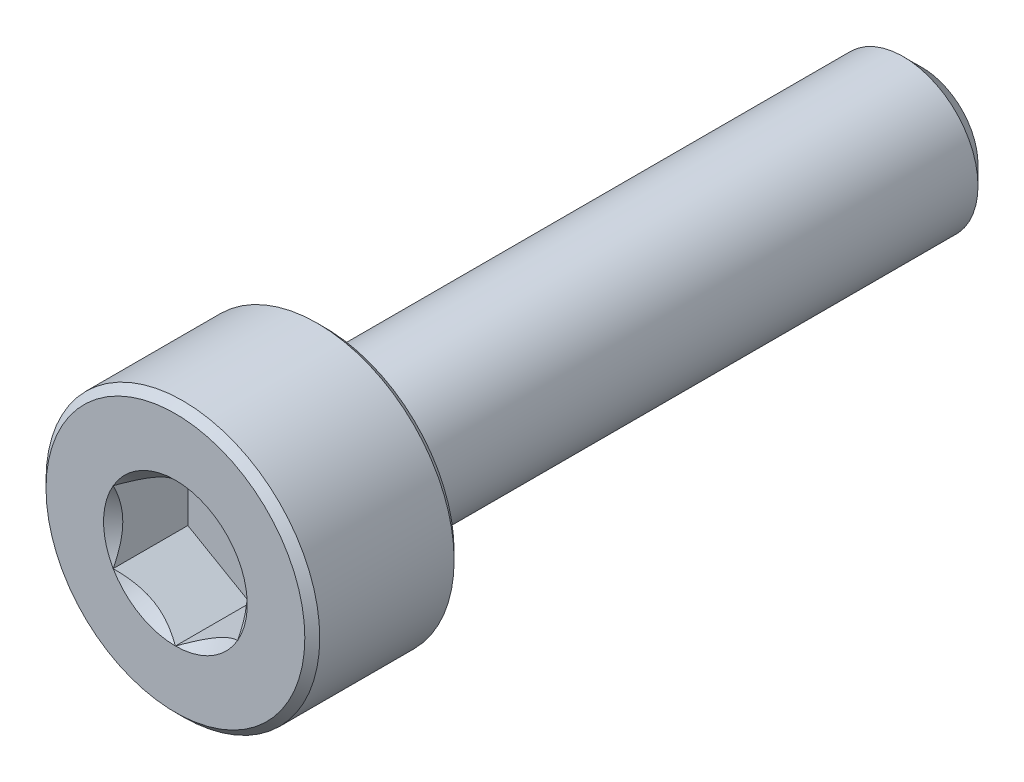
ISO-10303-21;
HEADER;
FILE_DESCRIPTION(('STEP AP214'),'2;1');
FILE_NAME('part.step','',(''),(''),'','','');
FILE_SCHEMA(('AUTOMOTIVE_DESIGN { 1 0 10303 214 1 1 1 1 }'));
ENDSEC;
DATA;
#1=APPLICATION_CONTEXT('core data for automotive mechanical design processes');
#2=APPLICATION_PROTOCOL_DEFINITION('international standard','automotive_design',2000,#1);
#3=PRODUCT_CONTEXT('',#1,'mechanical');
#4=PRODUCT('Part','Part','',(#3));
#5=PRODUCT_RELATED_PRODUCT_CATEGORY('part','',(#4));
#6=PRODUCT_DEFINITION_FORMATION('','',#4);
#7=PRODUCT_DEFINITION_CONTEXT('part definition',#1,'design');
#8=PRODUCT_DEFINITION('design','',#6,#7);
#9=PRODUCT_DEFINITION_SHAPE('','',#8);
#10=(LENGTH_UNIT() NAMED_UNIT(*) SI_UNIT(.MILLI.,.METRE.));
#11=(NAMED_UNIT(*) PLANE_ANGLE_UNIT() SI_UNIT($,.RADIAN.));
#12=(NAMED_UNIT(*) SI_UNIT($,.STERADIAN.) SOLID_ANGLE_UNIT());
#13=UNCERTAINTY_MEASURE_WITH_UNIT(LENGTH_MEASURE(1.E-05),#10,'distance_accuracy_value','');
#14=(GEOMETRIC_REPRESENTATION_CONTEXT(3) GLOBAL_UNCERTAINTY_ASSIGNED_CONTEXT((#13)) GLOBAL_UNIT_ASSIGNED_CONTEXT((#10,
#11,#12)) REPRESENTATION_CONTEXT('',''));
#15=CARTESIAN_POINT('',(0.,0.,0.));
#16=DIRECTION('',(0.,0.,1.));
#17=DIRECTION('',(1.,0.,0.));
#18=AXIS2_PLACEMENT_3D('',#15,#16,#17);
#19=CARTESIAN_POINT('',(0.,0.,7.5));
#20=DIRECTION('',(0.,0.,-1.));
#21=DIRECTION('',(-1.,0.,0.));
#22=AXIS2_PLACEMENT_3D('',#19,#20,#21);
#23=PLANE('',#22);
#24=CARTESIAN_POINT('',(0.,0.,7.5));
#25=DIRECTION('',(0.,0.,-1.));
#26=DIRECTION('',(-1.,0.,0.));
#27=AXIS2_PLACEMENT_3D('',#24,#25,#26);
#28=CIRCLE('',#27,2.6);
#29=CARTESIAN_POINT('',(-2.6,0.,7.5));
#30=VERTEX_POINT('',#29);
#31=EDGE_CURVE('E11',#30,#30,#28,.F.);
#32=ORIENTED_EDGE('',*,*,#31,.T.);
#33=EDGE_LOOP('',(#32));
#34=FACE_BOUND('',#33,.T.);
#35=CARTESIAN_POINT('',(0.,0.,7.5));
#36=DIRECTION('',(0.,0.,1.));
#37=DIRECTION('',(1.,0.,0.));
#38=AXIS2_PLACEMENT_3D('',#35,#36,#37);
#39=CIRCLE('',#38,1.44337567297407);
#40=CARTESIAN_POINT('',(-1.25,0.721687836487033,7.5));
#41=VERTEX_POINT('',#40);
#42=CARTESIAN_POINT('',(-1.25,-0.721687836487033,7.5));
#43=VERTEX_POINT('',#42);
#44=EDGE_CURVE('E129',#41,#43,#39,.T.);
#45=ORIENTED_EDGE('',*,*,#44,.F.);
#46=CARTESIAN_POINT('',(0.,1.44337567297407,7.5));
#47=VERTEX_POINT('',#46);
#48=EDGE_CURVE('E97',#47,#41,#39,.T.);
#49=ORIENTED_EDGE('',*,*,#48,.F.);
#50=CARTESIAN_POINT('',(1.25,0.721687836487033,7.5));
#51=VERTEX_POINT('',#50);
#52=EDGE_CURVE('E88',#51,#47,#39,.T.);
#53=ORIENTED_EDGE('',*,*,#52,.F.);
#54=CARTESIAN_POINT('',(1.25,-0.721687836487033,7.5));
#55=VERTEX_POINT('',#54);
#56=EDGE_CURVE('E49',#55,#51,#39,.T.);
#57=ORIENTED_EDGE('',*,*,#56,.F.);
#58=CARTESIAN_POINT('',(0.,-1.44337567297407,7.5));
#59=VERTEX_POINT('',#58);
#60=EDGE_CURVE('E56',#59,#55,#39,.T.);
#61=ORIENTED_EDGE('',*,*,#60,.F.);
#62=EDGE_CURVE('E130',#43,#59,#39,.T.);
#63=ORIENTED_EDGE('',*,*,#62,.F.);
#64=EDGE_LOOP('',(#45,#49,#53,#57,#61,#63));
#65=FACE_BOUND('',#64,.T.);
#66=ADVANCED_FACE('F35',(#34,#65),#23,.F.);
#67=CARTESIAN_POINT('',(0.,0.,7.5));
#68=DIRECTION('',(0.,0.,1.));
#69=DIRECTION('',(1.,0.,0.));
#70=AXIS2_PLACEMENT_3D('',#67,#68,#69);
#71=CYLINDRICAL_SURFACE('',#70,2.75);
#72=CARTESIAN_POINT('',(0.,0.,4.65));
#73=DIRECTION('',(0.,0.,1.));
#74=DIRECTION('',(1.,0.,0.));
#75=AXIS2_PLACEMENT_3D('',#72,#73,#74);
#76=CIRCLE('',#75,2.75);
#77=CARTESIAN_POINT('',(2.75,0.,4.65));
#78=VERTEX_POINT('',#77);
#79=EDGE_CURVE('E172',#78,#78,#76,.T.);
#80=ORIENTED_EDGE('',*,*,#79,.T.);
#81=EDGE_LOOP('',(#80));
#82=FACE_BOUND('',#81,.T.);
#83=CARTESIAN_POINT('',(0.,0.,7.35));
#84=DIRECTION('',(0.,0.,-1.));
#85=DIRECTION('',(-1.,0.,0.));
#86=AXIS2_PLACEMENT_3D('',#83,#84,#85);
#87=CIRCLE('',#86,2.75);
#88=CARTESIAN_POINT('',(-2.75,0.,7.35));
#89=VERTEX_POINT('',#88);
#90=EDGE_CURVE('E107',#89,#89,#87,.T.);
#91=ORIENTED_EDGE('',*,*,#90,.T.);
#92=EDGE_LOOP('',(#91));
#93=FACE_BOUND('',#92,.T.);
#94=ADVANCED_FACE('F185',(#82,#93),#71,.T.);
#95=CARTESIAN_POINT('',(0.,2.75,4.5));
#96=DIRECTION('',(0.,0.,1.));
#97=DIRECTION('',(1.,0.,0.));
#98=AXIS2_PLACEMENT_3D('',#95,#96,#97);
#99=PLANE('',#98);
#100=CARTESIAN_POINT('',(0.,0.,4.5));
#101=DIRECTION('',(0.,0.,1.));
#102=DIRECTION('',(1.,0.,0.));
#103=AXIS2_PLACEMENT_3D('',#100,#101,#102);
#104=CIRCLE('',#103,2.6);
#105=CARTESIAN_POINT('',(2.6,0.,4.5));
#106=VERTEX_POINT('',#105);
#107=EDGE_CURVE('E43',#106,#106,#104,.F.);
#108=ORIENTED_EDGE('',*,*,#107,.T.);
#109=EDGE_LOOP('',(#108));
#110=FACE_BOUND('',#109,.T.);
#111=CARTESIAN_POINT('',(0.,0.,4.5));
#112=DIRECTION('',(0.,0.,1.));
#113=DIRECTION('',(1.,0.,0.));
#114=AXIS2_PLACEMENT_3D('',#111,#112,#113);
#115=CIRCLE('',#114,1.5);
#116=CARTESIAN_POINT('',(1.5,0.,4.5));
#117=VERTEX_POINT('',#116);
#118=EDGE_CURVE('E108',#117,#117,#115,.T.);
#119=ORIENTED_EDGE('',*,*,#118,.T.);
#120=EDGE_LOOP('',(#119));
#121=FACE_BOUND('',#120,.T.);
#122=ADVANCED_FACE('F177',(#110,#121),#99,.F.);
#123=CARTESIAN_POINT('',(0.,0.,7.5));
#124=DIRECTION('',(0.,0.,1.));
#125=DIRECTION('',(1.,0.,0.));
#126=AXIS2_PLACEMENT_3D('',#123,#124,#125);
#127=CYLINDRICAL_SURFACE('',#126,1.5);
#128=ORIENTED_EDGE('',*,*,#118,.F.);
#129=EDGE_LOOP('',(#128));
#130=FACE_BOUND('',#129,.T.);
#131=CARTESIAN_POINT('',(0.,0.,-7.125));
#132=DIRECTION('',(0.,0.,1.));
#133=DIRECTION('',(1.,0.,0.));
#134=AXIS2_PLACEMENT_3D('',#131,#132,#133);
#135=CIRCLE('',#134,1.5);
#136=CARTESIAN_POINT('',(1.5,0.,-7.125));
#137=VERTEX_POINT('',#136);
#138=EDGE_CURVE('E222',#137,#137,#135,.T.);
#139=ORIENTED_EDGE('',*,*,#138,.T.);
#140=EDGE_LOOP('',(#139));
#141=FACE_BOUND('',#140,.T.);
#142=ADVANCED_FACE('F203',(#130,#141),#127,.T.);
#143=CARTESIAN_POINT('',(0.,0.,-7.5));
#144=DIRECTION('',(0.,0.,1.));
#145=DIRECTION('',(1.,0.,0.));
#146=AXIS2_PLACEMENT_3D('',#143,#144,#145);
#147=CONICAL_SURFACE('',#146,1.125,0.785398163397451);
#148=ORIENTED_EDGE('',*,*,#138,.F.);
#149=EDGE_LOOP('',(#148));
#150=FACE_BOUND('',#149,.T.);
#151=CARTESIAN_POINT('',(0.,0.,-7.5));
#152=DIRECTION('',(0.,0.,1.));
#153=DIRECTION('',(1.,0.,0.));
#154=AXIS2_PLACEMENT_3D('',#151,#152,#153);
#155=CIRCLE('',#154,1.125);
#156=CARTESIAN_POINT('',(1.125,0.,-7.5));
#157=VERTEX_POINT('',#156);
#158=EDGE_CURVE('E220',#157,#157,#155,.T.);
#159=ORIENTED_EDGE('',*,*,#158,.T.);
#160=EDGE_LOOP('',(#159));
#161=FACE_BOUND('',#160,.T.);
#162=ADVANCED_FACE('F206',(#150,#161),#147,.T.);
#163=CARTESIAN_POINT('',(0.,1.125,-7.5));
#164=DIRECTION('',(0.,0.,1.));
#165=DIRECTION('',(1.,0.,0.));
#166=AXIS2_PLACEMENT_3D('',#163,#164,#165);
#167=PLANE('',#166);
#168=ORIENTED_EDGE('',*,*,#158,.F.);
#169=EDGE_LOOP('',(#168));
#170=FACE_BOUND('',#169,.T.);
#171=ADVANCED_FACE('F209',(#170),#167,.F.);
#172=CARTESIAN_POINT('',(0.,0.,7.5));
#173=DIRECTION('',(0.,0.,1.));
#174=DIRECTION('',(1.,0.,0.));
#175=AXIS2_PLACEMENT_3D('',#172,#173,#174);
#176=CONICAL_SURFACE('',#175,1.44337567297407,0.78539816339745);
#177=ORIENTED_EDGE('',*,*,#48,.T.);
#178=CARTESIAN_POINT('',(0.000199999999999862,1.4434911430279,7.50011548390914));
#179=CARTESIAN_POINT('',(-0.0427751670715868,1.41867941875065,7.4753216680551));
#180=CARTESIAN_POINT('',(-0.0864690047459482,1.39345276980743,7.45198373441868));
#181=CARTESIAN_POINT('',(-0.175565930841942,1.34201263554194,7.40925200408454));
#182=CARTESIAN_POINT('',(-0.220977498357064,1.31579425481276,7.38988199236041));
#183=CARTESIAN_POINT('',(-0.31254782093526,1.26292610442246,7.35670048341348));
#184=CARTESIAN_POINT('',(-0.358683240175885,1.23628980770471,7.34280555905266));
#185=CARTESIAN_POINT('',(-0.451970080407592,1.18243062538508,7.32139728216064));
#186=CARTESIAN_POINT('',(-0.499118649136379,1.15520938653761,7.31386794156679));
#187=CARTESIAN_POINT('',(-0.580373556887252,1.10829684367467,7.3070744980507));
#188=CARTESIAN_POINT('',(-0.61437487662794,1.08866617256958,7.30606855910435));
#189=CARTESIAN_POINT('',(-0.682317764432477,1.04943932800611,7.30776141491132));
#190=CARTESIAN_POINT('',(-0.716259317655657,1.02984316311599,7.31046102721554));
#191=CARTESIAN_POINT('',(-0.783814856457499,0.9908399546035,7.31940893031638));
#192=CARTESIAN_POINT('',(-0.817428507286774,0.971433104248772,7.32566052589971));
#193=CARTESIAN_POINT('',(-0.884094638217812,0.932943395609906,7.3413756814139));
#194=CARTESIAN_POINT('',(-0.917146871030295,0.913860680098302,7.35084062008746));
#195=CARTESIAN_POINT('',(-1.00179969160026,0.864986351354569,7.37893139068759));
#196=CARTESIAN_POINT('',(-1.05286649242964,0.835502920149077,7.3996701574522));
#197=CARTESIAN_POINT('',(-1.15300085411326,0.777690319475909,7.44638713467148));
#198=CARTESIAN_POINT('',(-1.20207431157827,0.749357745598418,7.47234829594677));
#199=CARTESIAN_POINT('',(-1.2502,0.721572366433195,7.50011548390914));
#200=B_SPLINE_CURVE_WITH_KNOTS('',3,(#178,#179,#180,#181,#182,#183,#184,#185,#186,#187,#188,
#189,#190,#191,#192,#193,#194,#195,#196,#197,#198,#199),.UNSPECIFIED.,.F.,.F.,(4,2,2,2,2,2,2,2,
2,2,4),(0.,0.166533409618304,0.334037607289761,0.498880396489697,0.663307919240273,
0.780963963458826,0.898645970148452,1.01643764860773,1.13427993171549,1.32148652032141,
1.50809158792574),.UNSPECIFIED.);
#201=EDGE_CURVE('E102',#47,#41,#200,.T.);
#202=ORIENTED_EDGE('',*,*,#201,.F.);
#203=EDGE_LOOP('',(#177,#202));
#204=FACE_BOUND('',#203,.T.);
#205=ADVANCED_FACE('F103',(#204),#176,.F.);
#206=ORIENTED_EDGE('',*,*,#44,.T.);
#207=CARTESIAN_POINT('',(-1.25,-1.43934010829019,7.96298209705044));
#208=CARTESIAN_POINT('',(-1.25,-1.40429313026013,7.93652492278491));
#209=CARTESIAN_POINT('',(-1.25,-1.36905087155364,7.91032716050022));
#210=CARTESIAN_POINT('',(-1.25,-1.29809650724891,7.8585575719734));
#211=CARTESIAN_POINT('',(-1.25,-1.2623842859448,7.83298590448406));
#212=CARTESIAN_POINT('',(-1.25,-1.1539011180887,7.75700599379898));
#213=CARTESIAN_POINT('',(-1.25,-1.08031646741187,7.70774028628697));
#214=CARTESIAN_POINT('',(-1.25,-0.926012322877302,7.61102583033562));
#215=CARTESIAN_POINT('',(-1.25,-0.845125318763648,7.56384129900157));
#216=CARTESIAN_POINT('',(-1.25,-0.679311174153443,7.47753073442661));
#217=CARTESIAN_POINT('',(-1.25,-0.594398891087583,7.43837753465223));
#218=CARTESIAN_POINT('',(-1.25,-0.466944812509639,7.39047722370555));
#219=CARTESIAN_POINT('',(-1.25,-0.426289985866744,7.37672948980391));
#220=CARTESIAN_POINT('',(-1.25,-0.343998850155402,7.35249792746773));
#221=CARTESIAN_POINT('',(-1.25,-0.302362473684285,7.34201432388626));
#222=CARTESIAN_POINT('',(-1.25,-0.219052696365194,7.3250301617622));
#223=CARTESIAN_POINT('',(-1.25,-0.177393428559043,7.31846136048343));
#224=CARTESIAN_POINT('',(-1.25,-0.0936293694345974,7.30943505346499));
#225=CARTESIAN_POINT('',(-1.25,-0.0515246559536482,7.30697684100151));
#226=CARTESIAN_POINT('',(-1.25,0.0311890575224394,7.30635406201072));
#227=CARTESIAN_POINT('',(-1.25,0.0717969624376327,7.30803711683992));
#228=CARTESIAN_POINT('',(-1.25,0.152668636765093,7.31526827058346));
#229=CARTESIAN_POINT('',(-1.25,0.192932338711554,7.3208171103943));
#230=CARTESIAN_POINT('',(-1.25,0.273499879034189,7.33557103643701));
#231=CARTESIAN_POINT('',(-1.25,0.313792180483815,7.34483817593136));
#232=CARTESIAN_POINT('',(-1.25,0.393496413769926,7.36653617841489));
#233=CARTESIAN_POINT('',(-1.25,0.432908418970283,7.37896677668328));
#234=CARTESIAN_POINT('',(-1.25,0.556992735685998,7.42277935286094));
#235=CARTESIAN_POINT('',(-1.25,0.639898924463084,7.45915107278417));
#236=CARTESIAN_POINT('',(-1.25,0.801816555245349,7.54001916204164));
#237=CARTESIAN_POINT('',(-1.25,0.880812666046054,7.58454472075164));
#238=CARTESIAN_POINT('',(-1.25,1.03178561247421,7.67640487646102));
#239=CARTESIAN_POINT('',(-1.25,1.10391618450775,7.72348993368923));
#240=CARTESIAN_POINT('',(-1.25,1.2101860600607,7.79627856133952));
#241=CARTESIAN_POINT('',(-1.25,1.24515069931176,7.82079808512376));
#242=CARTESIAN_POINT('',(-1.25,1.31460220812615,7.87048563647493));
#243=CARTESIAN_POINT('',(-1.25,1.3490892055554,7.8956534851142));
#244=CARTESIAN_POINT('',(-1.25,1.38337731640879,7.92109014852934));
#245=B_SPLINE_CURVE_WITH_KNOTS('',3,(#207,#208,#209,#210,#211,#212,#213,#214,#215,#216,#217,
#218,#219,#220,#221,#222,#223,#224,#225,#226,#227,#228,#229,#230,#231,#232,#233,#234,#235,#236,
#237,#238,#239,#240,#241,#242,#243,#244),.UNSPECIFIED.,.F.,.F.,(4,2,2,2,2,2,2,2,2,2,2,2,2,2,2,2,
2,2,4),(0.,0.131732960406522,0.2634989842118,0.529042014557081,0.809741926293179,
1.08947609738757,1.21811634292656,1.34676544802529,1.47310084535082,1.59941451989631,
1.72115042182424,1.84290966145034,1.96679153917269,2.09066305376595,2.36146692896707,
2.63325989189267,2.89154668194565,3.01965734485811,3.1477330221954),.UNSPECIFIED.);
#246=EDGE_CURVE('E96',#41,#43,#245,.F.);
#247=ORIENTED_EDGE('',*,*,#246,.F.);
#248=EDGE_LOOP('',(#206,#247));
#249=FACE_BOUND('',#248,.T.);
#250=ADVANCED_FACE('F217',(#249),#176,.F.);
#251=ORIENTED_EDGE('',*,*,#62,.T.);
#252=CARTESIAN_POINT('',(-1.2502,-0.721572366433194,7.50011548390914));
#253=CARTESIAN_POINT('',(-1.20722483292841,-0.746384090710444,7.4753216680551));
#254=CARTESIAN_POINT('',(-1.16353099525405,-0.771610739653664,7.45198373441868));
#255=CARTESIAN_POINT('',(-1.07443406915806,-0.823050873919154,7.40925200408454));
#256=CARTESIAN_POINT('',(-1.02902250164294,-0.849269254648333,7.38988199236041));
#257=CARTESIAN_POINT('',(-0.937452179064741,-0.902137405038635,7.35670048341347));
#258=CARTESIAN_POINT('',(-0.891316759824115,-0.928773701756387,7.34280555905265));
#259=CARTESIAN_POINT('',(-0.798029919592408,-0.982632884076012,7.32139728216064));
#260=CARTESIAN_POINT('',(-0.75088135086362,-1.00985412292348,7.31386794156679));
#261=CARTESIAN_POINT('',(-0.669626443112748,-1.05676666578643,7.3070744980507));
#262=CARTESIAN_POINT('',(-0.635625123372059,-1.07639733689152,7.30606855910435));
#263=CARTESIAN_POINT('',(-0.567682235567523,-1.11562418145499,7.30776141491132));
#264=CARTESIAN_POINT('',(-0.533740682344343,-1.1352203463451,7.31046102721554));
#265=CARTESIAN_POINT('',(-0.466185143542501,-1.1742235548576,7.31940893031638));
#266=CARTESIAN_POINT('',(-0.432571492713225,-1.19363040521233,7.3256605258997));
#267=CARTESIAN_POINT('',(-0.365905361782187,-1.23212011385119,7.3413756814139));
#268=CARTESIAN_POINT('',(-0.332853128969705,-1.2512028293628,7.35084062008746));
#269=CARTESIAN_POINT('',(-0.248200308399735,-1.30007715810653,7.37893139068758));
#270=CARTESIAN_POINT('',(-0.197133507570362,-1.32956058931202,7.3996701574522));
#271=CARTESIAN_POINT('',(-0.0969991458867448,-1.38737318998519,7.44638713467148));
#272=CARTESIAN_POINT('',(-0.04792568842173,-1.41570576386268,7.47234829594677));
#273=CARTESIAN_POINT('',(0.000200000000000719,-1.4434911430279,7.50011548390914));
#274=B_SPLINE_CURVE_WITH_KNOTS('',3,(#252,#253,#254,#255,#256,#257,#258,#259,#260,#261,#262,
#263,#264,#265,#266,#267,#268,#269,#270,#271,#272,#273),.UNSPECIFIED.,.F.,.F.,(4,2,2,2,2,2,2,2,
2,2,4),(0.,0.166533409618304,0.334037607289762,0.498880396489699,0.663307919240275,
0.780963963458827,0.898645970148453,1.01643764860773,1.1342799317155,1.32148652032141,
1.50809158792574),.UNSPECIFIED.);
#275=EDGE_CURVE('E140',#43,#59,#274,.T.);
#276=ORIENTED_EDGE('',*,*,#275,.F.);
#277=EDGE_LOOP('',(#251,#276));
#278=FACE_BOUND('',#277,.T.);
#279=ADVANCED_FACE('F282',(#278),#176,.F.);
#280=ORIENTED_EDGE('',*,*,#60,.T.);
#281=CARTESIAN_POINT('',(-0.000199999999999386,-1.4434911430279,7.50011548390914));
#282=CARTESIAN_POINT('',(0.0427751670715872,-1.41867941875065,7.4753216680551));
#283=CARTESIAN_POINT('',(0.0864690047459485,-1.39345276980743,7.45198373441868));
#284=CARTESIAN_POINT('',(0.175565930841942,-1.34201263554194,7.40925200408454));
#285=CARTESIAN_POINT('',(0.220977498357064,-1.31579425481276,7.38988199236041));
#286=CARTESIAN_POINT('',(0.31254782093526,-1.26292610442246,7.35670048341348));
#287=CARTESIAN_POINT('',(0.358683240175886,-1.23628980770471,7.34280555905266));
#288=CARTESIAN_POINT('',(0.451970080407592,-1.18243062538508,7.32139728216064));
#289=CARTESIAN_POINT('',(0.49911864913638,-1.15520938653761,7.31386794156679));
#290=CARTESIAN_POINT('',(0.580373556887252,-1.10829684367467,7.3070744980507));
#291=CARTESIAN_POINT('',(0.614374876627941,-1.08866617256958,7.30606855910435));
#292=CARTESIAN_POINT('',(0.682317764432478,-1.04943932800611,7.30776141491132));
#293=CARTESIAN_POINT('',(0.716259317655658,-1.02984316311599,7.31046102721554));
#294=CARTESIAN_POINT('',(0.7838148564575,-0.9908399546035,7.31940893031638));
#295=CARTESIAN_POINT('',(0.817428507286775,-0.971433104248772,7.32566052589971));
#296=CARTESIAN_POINT('',(0.884094638217813,-0.932943395609906,7.3413756814139));
#297=CARTESIAN_POINT('',(0.917146871030296,-0.913860680098301,7.35084062008746));
#298=CARTESIAN_POINT('',(1.00179969160026,-0.864986351354569,7.37893139068759));
#299=CARTESIAN_POINT('',(1.05286649242964,-0.835502920149077,7.3996701574522));
#300=CARTESIAN_POINT('',(1.15300085411325,-0.777690319475909,7.44638713467148));
#301=CARTESIAN_POINT('',(1.20207431157827,-0.749357745598418,7.47234829594677));
#302=CARTESIAN_POINT('',(1.2502,-0.721572366433195,7.50011548390914));
#303=B_SPLINE_CURVE_WITH_KNOTS('',3,(#281,#282,#283,#284,#285,#286,#287,#288,#289,#290,#291,
#292,#293,#294,#295,#296,#297,#298,#299,#300,#301,#302),.UNSPECIFIED.,.F.,.F.,(4,2,2,2,2,2,2,2,
2,2,4),(0.,0.166533409618303,0.334037607289761,0.498880396489697,0.663307919240273,
0.780963963458826,0.898645970148452,1.01643764860773,1.13427993171549,1.32148652032141,
1.50809158792573),.UNSPECIFIED.);
#304=EDGE_CURVE('E259',#59,#55,#303,.T.);
#305=ORIENTED_EDGE('',*,*,#304,.F.);
#306=EDGE_LOOP('',(#280,#305));
#307=FACE_BOUND('',#306,.T.);
#308=ADVANCED_FACE('F283',(#307),#176,.F.);
#309=ORIENTED_EDGE('',*,*,#56,.T.);
#310=CARTESIAN_POINT('',(1.25,-1.43934010808077,7.96298209689233));
#311=CARTESIAN_POINT('',(1.25,-1.40429313005659,7.93652492263289));
#312=CARTESIAN_POINT('',(1.25,-1.36905087135599,7.91032716035428));
#313=CARTESIAN_POINT('',(1.25,-1.29809650706311,7.85855757183958));
#314=CARTESIAN_POINT('',(1.25,-1.26238428576495,7.83298590435629));
#315=CARTESIAN_POINT('',(1.25,-1.15390111792708,7.75700599368946));
#316=CARTESIAN_POINT('',(1.25,-1.08031646726264,7.70774028618957));
#317=CARTESIAN_POINT('',(1.25,-0.926012322755096,7.61102583026313));
#318=CARTESIAN_POINT('',(1.25,-0.845125318656147,7.5638412989418));
#319=CARTESIAN_POINT('',(1.25,-0.679311174076603,7.47753073439041));
#320=CARTESIAN_POINT('',(1.25,-0.594398891026688,7.4383775346269));
#321=CARTESIAN_POINT('',(1.25,-0.466944812460741,7.39047722368829));
#322=CARTESIAN_POINT('',(1.25,-0.426289985812822,7.37672948978634));
#323=CARTESIAN_POINT('',(1.25,-0.343998850091268,7.35249792745054));
#324=CARTESIAN_POINT('',(1.25,-0.302362473614962,7.34201432386977));
#325=CARTESIAN_POINT('',(1.25,-0.219052696285666,7.3250301617483));
#326=CARTESIAN_POINT('',(1.25,-0.1773934284745,7.31846136047137));
#327=CARTESIAN_POINT('',(1.25,-0.0936293693401926,7.30943505345776));
#328=CARTESIAN_POINT('',(1.25,-0.0515246558543965,7.30697684099727));
#329=CARTESIAN_POINT('',(1.25,0.0311890576306311,7.30635406201328));
#330=CARTESIAN_POINT('',(1.25,0.0717969625499299,7.30803711684625));
#331=CARTESIAN_POINT('',(1.25,0.152668636885197,7.31526827059791));
#332=CARTESIAN_POINT('',(1.25,0.192932338835358,7.32081711041311));
#333=CARTESIAN_POINT('',(1.25,0.273499879165295,7.33557103646495));
#334=CARTESIAN_POINT('',(1.25,0.313792180618511,7.3448381759641));
#335=CARTESIAN_POINT('',(1.25,0.393496413911457,7.36653617845735));
#336=CARTESIAN_POINT('',(1.25,0.432908419115059,7.37896677673064));
#337=CARTESIAN_POINT('',(1.25,0.556992735862298,7.42277935293144));
#338=CARTESIAN_POINT('',(1.25,0.639898924666086,7.45915107287596));
#339=CARTESIAN_POINT('',(1.25,0.801816555499702,7.54001916217833));
#340=CARTESIAN_POINT('',(1.25,0.880812666325045,7.58454472091199));
#341=CARTESIAN_POINT('',(1.25,1.0317856127975,7.67640487666662));
#342=CARTESIAN_POINT('',(1.25,1.10391618485086,7.72348993391625));
#343=CARTESIAN_POINT('',(1.25,1.21018606043311,7.79627856159854));
#344=CARTESIAN_POINT('',(1.25,1.24515069969379,7.82079808539336));
#345=CARTESIAN_POINT('',(1.25,1.31460220852736,7.87048563676568));
#346=CARTESIAN_POINT('',(1.25,1.34908920596618,7.89565348541552));
#347=CARTESIAN_POINT('',(1.25,1.38337731682912,7.92109014884121));
#348=B_SPLINE_CURVE_WITH_KNOTS('',3,(#310,#311,#312,#313,#314,#315,#316,#317,#318,#319,#320,
#321,#322,#323,#324,#325,#326,#327,#328,#329,#330,#331,#332,#333,#334,#335,#336,#337,#338,#339,
#340,#341,#342,#343,#344,#345,#346,#347),.UNSPECIFIED.,.F.,.F.,(4,2,2,2,2,2,2,2,2,2,2,2,2,2,2,2,
2,2,4),(0.,0.131732960381448,0.263498984161645,0.529042014455825,0.809741926134618,
1.08947609717225,1.21811634272577,1.346765447839,1.47310084517844,1.59941451973784,
1.72115042167849,1.84290966131735,1.96679153905342,2.09066305366039,2.36146692896009,
2.63325989198491,2.89154668212279,3.01965734507713,3.14773302245628),.UNSPECIFIED.);
#349=EDGE_CURVE('E118',#55,#51,#348,.T.);
#350=ORIENTED_EDGE('',*,*,#349,.F.);
#351=EDGE_LOOP('',(#309,#350));
#352=FACE_BOUND('',#351,.T.);
#353=ADVANCED_FACE('F293',(#352),#176,.F.);
#354=ORIENTED_EDGE('',*,*,#52,.T.);
#355=CARTESIAN_POINT('',(1.2502,0.721572366433194,7.50011548390914));
#356=CARTESIAN_POINT('',(1.20722483292841,0.746384090710444,7.4753216680551));
#357=CARTESIAN_POINT('',(1.16353099525405,0.771610739653664,7.45198373441868));
#358=CARTESIAN_POINT('',(1.07443406915806,0.823050873919155,7.40925200408454));
#359=CARTESIAN_POINT('',(1.02902250164294,0.849269254648333,7.38988199236041));
#360=CARTESIAN_POINT('',(0.937452179064741,0.902137405038635,7.35670048341348));
#361=CARTESIAN_POINT('',(0.891316759824115,0.928773701756387,7.34280555905265));
#362=CARTESIAN_POINT('',(0.798029919592409,0.982632884076012,7.32139728216064));
#363=CARTESIAN_POINT('',(0.750881350863621,1.00985412292348,7.31386794156679));
#364=CARTESIAN_POINT('',(0.669626443112749,1.05676666578643,7.3070744980507));
#365=CARTESIAN_POINT('',(0.63562512337206,1.07639733689152,7.30606855910435));
#366=CARTESIAN_POINT('',(0.567682235567524,1.11562418145499,7.30776141491132));
#367=CARTESIAN_POINT('',(0.533740682344344,1.1352203463451,7.31046102721554));
#368=CARTESIAN_POINT('',(0.466185143542502,1.1742235548576,7.31940893031638));
#369=CARTESIAN_POINT('',(0.432571492713226,1.19363040521233,7.32566052589971));
#370=CARTESIAN_POINT('',(0.365905361782188,1.23212011385119,7.3413756814139));
#371=CARTESIAN_POINT('',(0.332853128969705,1.2512028293628,7.35084062008746));
#372=CARTESIAN_POINT('',(0.248200308399736,1.30007715810653,7.37893139068758));
#373=CARTESIAN_POINT('',(0.197133507570363,1.32956058931202,7.3996701574522));
#374=CARTESIAN_POINT('',(0.0969991458867456,1.38737318998519,7.44638713467148));
#375=CARTESIAN_POINT('',(0.0479256884217309,1.41570576386268,7.47234829594677));
#376=CARTESIAN_POINT('',(-0.000199999999999908,1.4434911430279,7.50011548390914));
#377=B_SPLINE_CURVE_WITH_KNOTS('',3,(#355,#356,#357,#358,#359,#360,#361,#362,#363,#364,#365,
#366,#367,#368,#369,#370,#371,#372,#373,#374,#375,#376),.UNSPECIFIED.,.F.,.F.,(4,2,2,2,2,2,2,2,
2,2,4),(0.,0.166533409618304,0.334037607289761,0.498880396489698,0.663307919240274,
0.780963963458826,0.898645970148453,1.01643764860773,1.13427993171549,1.32148652032141,
1.50809158792574),.UNSPECIFIED.);
#378=EDGE_CURVE('E92',#51,#47,#377,.T.);
#379=ORIENTED_EDGE('',*,*,#378,.F.);
#380=EDGE_LOOP('',(#354,#379));
#381=FACE_BOUND('',#380,.T.);
#382=ADVANCED_FACE('F90',(#381),#176,.F.);
#383=CARTESIAN_POINT('',(0.,0.,6.));
#384=DIRECTION('',(0.,0.,1.));
#385=DIRECTION('',(1.,0.,0.));
#386=AXIS2_PLACEMENT_3D('',#383,#384,#385);
#387=PLANE('',#386);
#388=DIRECTION('',(-0.866025403784438,0.5,0.));
#389=VECTOR('',#388,1.);
#390=CARTESIAN_POINT('',(1.25,0.721687836487032,6.));
#391=LINE('',#390,#389);
#392=CARTESIAN_POINT('',(1.25,0.721687836487032,6.));
#393=VERTEX_POINT('',#392);
#394=CARTESIAN_POINT('',(0.,1.44337567297407,6.));
#395=VERTEX_POINT('',#394);
#396=EDGE_CURVE('E117',#393,#395,#391,.T.);
#397=ORIENTED_EDGE('',*,*,#396,.T.);
#398=DIRECTION('',(-0.866025403784439,-0.5,0.));
#399=VECTOR('',#398,1.);
#400=CARTESIAN_POINT('',(0.,1.44337567297407,6.));
#401=LINE('',#400,#399);
#402=CARTESIAN_POINT('',(-1.25,0.721687836487033,6.));
#403=VERTEX_POINT('',#402);
#404=EDGE_CURVE('E122',#395,#403,#401,.T.);
#405=ORIENTED_EDGE('',*,*,#404,.T.);
#406=DIRECTION('',(0.,-1.,0.));
#407=VECTOR('',#406,1.);
#408=CARTESIAN_POINT('',(-1.25,0.721687836487033,6.));
#409=LINE('',#408,#407);
#410=CARTESIAN_POINT('',(-1.25,-0.721687836487032,6.));
#411=VERTEX_POINT('',#410);
#412=EDGE_CURVE('E245',#403,#411,#409,.T.);
#413=ORIENTED_EDGE('',*,*,#412,.T.);
#414=DIRECTION('',(0.866025403784439,-0.5,0.));
#415=VECTOR('',#414,1.);
#416=CARTESIAN_POINT('',(-1.25,-0.721687836487032,6.));
#417=LINE('',#416,#415);
#418=CARTESIAN_POINT('',(0.,-1.44337567297406,6.));
#419=VERTEX_POINT('',#418);
#420=EDGE_CURVE('E242',#411,#419,#417,.T.);
#421=ORIENTED_EDGE('',*,*,#420,.T.);
#422=DIRECTION('',(0.866025403784439,0.5,0.));
#423=VECTOR('',#422,1.);
#424=CARTESIAN_POINT('',(0.,-1.44337567297406,6.));
#425=LINE('',#424,#423);
#426=CARTESIAN_POINT('',(1.25,-0.721687836487033,6.));
#427=VERTEX_POINT('',#426);
#428=EDGE_CURVE('E239',#419,#427,#425,.T.);
#429=ORIENTED_EDGE('',*,*,#428,.T.);
#430=DIRECTION('',(0.,1.,0.));
#431=VECTOR('',#430,1.);
#432=CARTESIAN_POINT('',(1.25,-0.721687836487033,6.));
#433=LINE('',#432,#431);
#434=EDGE_CURVE('E125',#427,#393,#433,.T.);
#435=ORIENTED_EDGE('',*,*,#434,.T.);
#436=EDGE_LOOP('',(#397,#405,#413,#421,#429,#435));
#437=FACE_BOUND('',#436,.T.);
#438=ADVANCED_FACE('F160',(#437),#387,.T.);
#439=CARTESIAN_POINT('',(0.,1.44337567297407,6.));
#440=DIRECTION('',(-0.5,0.866025403784439,0.));
#441=DIRECTION('',(-0.866025403784439,-0.5,0.));
#442=AXIS2_PLACEMENT_3D('',#439,#440,#441);
#443=PLANE('',#442);
#444=DIRECTION('',(0.,0.,1.));
#445=VECTOR('',#444,1.);
#446=CARTESIAN_POINT('',(0.,1.44337567297407,6.));
#447=LINE('',#446,#445);
#448=EDGE_CURVE('E114',#395,#47,#447,.T.);
#449=ORIENTED_EDGE('',*,*,#448,.T.);
#450=ORIENTED_EDGE('',*,*,#201,.T.);
#451=DIRECTION('',(0.,0.,1.));
#452=VECTOR('',#451,1.);
#453=CARTESIAN_POINT('',(-1.25,0.721687836487033,6.));
#454=LINE('',#453,#452);
#455=EDGE_CURVE('E124',#403,#41,#454,.T.);
#456=ORIENTED_EDGE('',*,*,#455,.F.);
#457=ORIENTED_EDGE('',*,*,#404,.F.);
#458=EDGE_LOOP('',(#449,#450,#456,#457));
#459=FACE_BOUND('',#458,.T.);
#460=ADVANCED_FACE('F120',(#459),#443,.F.);
#461=CARTESIAN_POINT('',(-1.25,0.721687836487033,6.));
#462=DIRECTION('',(-1.,0.,0.));
#463=DIRECTION('',(0.,-1.,0.));
#464=AXIS2_PLACEMENT_3D('',#461,#462,#463);
#465=PLANE('',#464);
#466=ORIENTED_EDGE('',*,*,#455,.T.);
#467=ORIENTED_EDGE('',*,*,#246,.T.);
#468=DIRECTION('',(0.,0.,1.));
#469=VECTOR('',#468,1.);
#470=CARTESIAN_POINT('',(-1.25,-0.721687836487032,6.));
#471=LINE('',#470,#469);
#472=EDGE_CURVE('E229',#411,#43,#471,.T.);
#473=ORIENTED_EDGE('',*,*,#472,.F.);
#474=ORIENTED_EDGE('',*,*,#412,.F.);
#475=EDGE_LOOP('',(#466,#467,#473,#474));
#476=FACE_BOUND('',#475,.T.);
#477=ADVANCED_FACE('F149',(#476),#465,.F.);
#478=CARTESIAN_POINT('',(-1.25,-0.721687836487032,6.));
#479=DIRECTION('',(-0.5,-0.866025403784439,0.));
#480=DIRECTION('',(0.866025403784439,-0.5,0.));
#481=AXIS2_PLACEMENT_3D('',#478,#479,#480);
#482=PLANE('',#481);
#483=ORIENTED_EDGE('',*,*,#472,.T.);
#484=ORIENTED_EDGE('',*,*,#275,.T.);
#485=DIRECTION('',(0.,0.,1.));
#486=VECTOR('',#485,1.);
#487=CARTESIAN_POINT('',(0.,-1.44337567297406,6.));
#488=LINE('',#487,#486);
#489=EDGE_CURVE('E232',#419,#59,#488,.T.);
#490=ORIENTED_EDGE('',*,*,#489,.F.);
#491=ORIENTED_EDGE('',*,*,#420,.F.);
#492=EDGE_LOOP('',(#483,#484,#490,#491));
#493=FACE_BOUND('',#492,.T.);
#494=ADVANCED_FACE('F153',(#493),#482,.F.);
#495=CARTESIAN_POINT('',(0.,-1.44337567297406,6.));
#496=DIRECTION('',(0.5,-0.866025403784439,0.));
#497=DIRECTION('',(0.866025403784439,0.5,0.));
#498=AXIS2_PLACEMENT_3D('',#495,#496,#497);
#499=PLANE('',#498);
#500=ORIENTED_EDGE('',*,*,#489,.T.);
#501=ORIENTED_EDGE('',*,*,#304,.T.);
#502=DIRECTION('',(0.,0.,1.));
#503=VECTOR('',#502,1.);
#504=CARTESIAN_POINT('',(1.25,-0.721687836487033,6.));
#505=LINE('',#504,#503);
#506=EDGE_CURVE('E225',#427,#55,#505,.T.);
#507=ORIENTED_EDGE('',*,*,#506,.F.);
#508=ORIENTED_EDGE('',*,*,#428,.F.);
#509=EDGE_LOOP('',(#500,#501,#507,#508));
#510=FACE_BOUND('',#509,.T.);
#511=ADVANCED_FACE('F267',(#510),#499,.F.);
#512=CARTESIAN_POINT('',(1.25,-0.721687836487033,6.));
#513=DIRECTION('',(1.,0.,0.));
#514=DIRECTION('',(0.,1.,0.));
#515=AXIS2_PLACEMENT_3D('',#512,#513,#514);
#516=PLANE('',#515);
#517=ORIENTED_EDGE('',*,*,#506,.T.);
#518=ORIENTED_EDGE('',*,*,#349,.T.);
#519=DIRECTION('',(0.,0.,1.));
#520=VECTOR('',#519,1.);
#521=CARTESIAN_POINT('',(1.25,0.721687836487032,6.));
#522=LINE('',#521,#520);
#523=EDGE_CURVE('E116',#393,#51,#522,.T.);
#524=ORIENTED_EDGE('',*,*,#523,.F.);
#525=ORIENTED_EDGE('',*,*,#434,.F.);
#526=EDGE_LOOP('',(#517,#518,#524,#525));
#527=FACE_BOUND('',#526,.T.);
#528=ADVANCED_FACE('F264',(#527),#516,.F.);
#529=CARTESIAN_POINT('',(1.25,0.721687836487032,6.));
#530=DIRECTION('',(0.5,0.866025403784439,0.));
#531=DIRECTION('',(-0.866025403784439,0.5,0.));
#532=AXIS2_PLACEMENT_3D('',#529,#530,#531);
#533=PLANE('',#532);
#534=ORIENTED_EDGE('',*,*,#523,.T.);
#535=ORIENTED_EDGE('',*,*,#378,.T.);
#536=ORIENTED_EDGE('',*,*,#448,.F.);
#537=ORIENTED_EDGE('',*,*,#396,.F.);
#538=EDGE_LOOP('',(#534,#535,#536,#537));
#539=FACE_BOUND('',#538,.T.);
#540=ADVANCED_FACE('F112',(#539),#533,.F.);
#541=CARTESIAN_POINT('',(0.,0.,4.65));
#542=DIRECTION('',(0.,0.,1.));
#543=DIRECTION('',(1.,0.,0.));
#544=AXIS2_PLACEMENT_3D('',#541,#542,#543);
#545=CONICAL_SURFACE('',#544,2.75,0.785398163397455);
#546=ORIENTED_EDGE('',*,*,#107,.F.);
#547=EDGE_LOOP('',(#546));
#548=FACE_BOUND('',#547,.T.);
#549=ORIENTED_EDGE('',*,*,#79,.F.);
#550=EDGE_LOOP('',(#549));
#551=FACE_BOUND('',#550,.T.);
#552=ADVANCED_FACE('F180',(#548,#551),#545,.T.);
#553=CARTESIAN_POINT('',(0.,0.,7.5));
#554=DIRECTION('',(0.,0.,-1.));
#555=DIRECTION('',(-1.,0.,0.));
#556=AXIS2_PLACEMENT_3D('',#553,#554,#555);
#557=CONICAL_SURFACE('',#556,2.6,0.785398163397444);
#558=ORIENTED_EDGE('',*,*,#90,.F.);
#559=EDGE_LOOP('',(#558));
#560=FACE_BOUND('',#559,.T.);
#561=ORIENTED_EDGE('',*,*,#31,.F.);
#562=EDGE_LOOP('',(#561));
#563=FACE_BOUND('',#562,.T.);
#564=ADVANCED_FACE('F37',(#560,#563),#557,.T.);
#565=CLOSED_SHELL('',(#66,#94,#122,#142,#162,#171,#205,#250,#279,#308,#353,#382,#438,#460,#477,
#494,#511,#528,#540,#552,#564));
#566=MANIFOLD_SOLID_BREP('B2',#565);
#567=ADVANCED_BREP_SHAPE_REPRESENTATION('',(#18,#566),#14);
#568=SHAPE_DEFINITION_REPRESENTATION(#9,#567);
ENDSEC;
END-ISO-10303-21;
